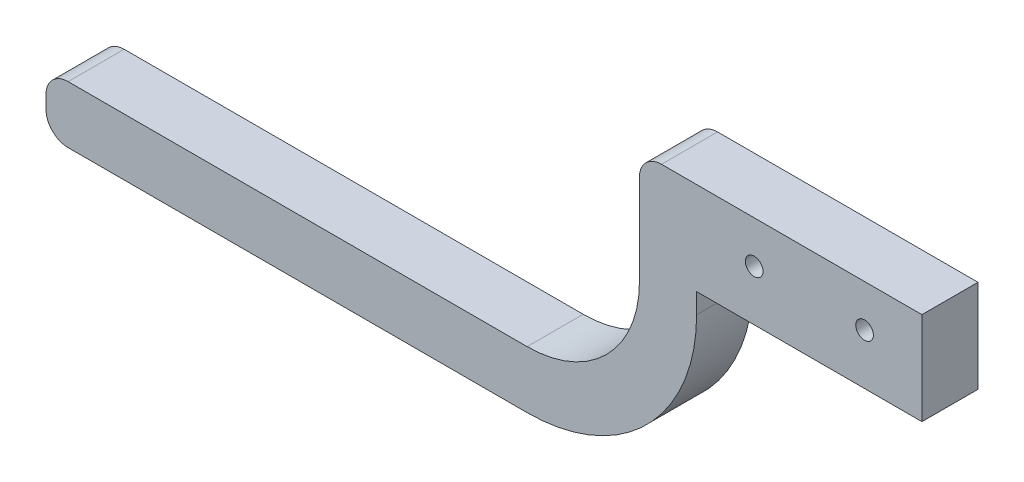
ISO-10303-21;
HEADER;
FILE_DESCRIPTION(('STEP AP214'),'2;1');
FILE_NAME('part.step','',(''),(''),'','','');
FILE_SCHEMA(('AUTOMOTIVE_DESIGN { 1 0 10303 214 1 1 1 1 }'));
ENDSEC;
DATA;
#1=APPLICATION_CONTEXT('core data for automotive mechanical design processes');
#2=APPLICATION_PROTOCOL_DEFINITION('international standard','automotive_design',2000,#1);
#3=PRODUCT_CONTEXT('',#1,'mechanical');
#4=PRODUCT('Part','Part','',(#3));
#5=PRODUCT_RELATED_PRODUCT_CATEGORY('part','',(#4));
#6=PRODUCT_DEFINITION_FORMATION('','',#4);
#7=PRODUCT_DEFINITION_CONTEXT('part definition',#1,'design');
#8=PRODUCT_DEFINITION('design','',#6,#7);
#9=PRODUCT_DEFINITION_SHAPE('','',#8);
#10=(LENGTH_UNIT() NAMED_UNIT(*) SI_UNIT(.MILLI.,.METRE.));
#11=(NAMED_UNIT(*) PLANE_ANGLE_UNIT() SI_UNIT($,.RADIAN.));
#12=(NAMED_UNIT(*) SI_UNIT($,.STERADIAN.) SOLID_ANGLE_UNIT());
#13=UNCERTAINTY_MEASURE_WITH_UNIT(LENGTH_MEASURE(1.E-05),#10,'distance_accuracy_value','');
#14=(GEOMETRIC_REPRESENTATION_CONTEXT(3) GLOBAL_UNCERTAINTY_ASSIGNED_CONTEXT((#13)) GLOBAL_UNIT_ASSIGNED_CONTEXT((#10,
#11,#12)) REPRESENTATION_CONTEXT('',''));
#15=CARTESIAN_POINT('',(0.,0.,0.));
#16=DIRECTION('',(0.,0.,1.));
#17=DIRECTION('',(1.,0.,0.));
#18=AXIS2_PLACEMENT_3D('',#15,#16,#17);
#19=CARTESIAN_POINT('',(0.,0.,12.7));
#20=DIRECTION('',(-1.,0.,0.));
#21=DIRECTION('',(0.,-1.,0.));
#22=AXIS2_PLACEMENT_3D('',#19,#20,#21);
#23=PLANE('',#22);
#24=DIRECTION('',(0.,1.,0.));
#25=VECTOR('',#24,1.);
#26=CARTESIAN_POINT('',(0.,0.,0.));
#27=LINE('',#26,#25);
#28=CARTESIAN_POINT('',(0.,-21.,0.));
#29=VERTEX_POINT('',#28);
#30=CARTESIAN_POINT('',(0.,0.,0.));
#31=VERTEX_POINT('',#30);
#32=EDGE_CURVE('E157',#29,#31,#27,.T.);
#33=ORIENTED_EDGE('',*,*,#32,.T.);
#34=DIRECTION('',(0.,0.,-1.));
#35=VECTOR('',#34,1.);
#36=CARTESIAN_POINT('',(0.,0.,12.7));
#37=LINE('',#36,#35);
#38=CARTESIAN_POINT('',(0.,0.,12.7));
#39=VERTEX_POINT('',#38);
#40=EDGE_CURVE('E139',#39,#31,#37,.T.);
#41=ORIENTED_EDGE('',*,*,#40,.F.);
#42=DIRECTION('',(0.,1.,0.));
#43=VECTOR('',#42,1.);
#44=CARTESIAN_POINT('',(0.,0.,12.7));
#45=LINE('',#44,#43);
#46=CARTESIAN_POINT('',(0.,-21.,12.7));
#47=VERTEX_POINT('',#46);
#48=EDGE_CURVE('E145',#47,#39,#45,.T.);
#49=ORIENTED_EDGE('',*,*,#48,.F.);
#50=DIRECTION('',(0.,0.,-1.));
#51=VECTOR('',#50,1.);
#52=CARTESIAN_POINT('',(0.,-21.,12.7));
#53=LINE('',#52,#51);
#54=EDGE_CURVE('E211',#47,#29,#53,.T.);
#55=ORIENTED_EDGE('',*,*,#54,.T.);
#56=EDGE_LOOP('',(#33,#41,#49,#55));
#57=FACE_BOUND('',#56,.T.);
#58=ADVANCED_FACE('F39',(#57),#23,.F.);
#59=CARTESIAN_POINT('',(0.,0.,12.7));
#60=DIRECTION('',(0.,-1.,0.));
#61=DIRECTION('',(1.,0.,0.));
#62=AXIS2_PLACEMENT_3D('',#59,#60,#61);
#63=PLANE('',#62);
#64=DIRECTION('',(-1.,0.,0.));
#65=VECTOR('',#64,1.);
#66=CARTESIAN_POINT('',(0.,0.,0.));
#67=LINE('',#66,#65);
#68=CARTESIAN_POINT('',(-59.,0.,0.));
#69=VERTEX_POINT('',#68);
#70=EDGE_CURVE('E233',#31,#69,#67,.T.);
#71=ORIENTED_EDGE('',*,*,#70,.T.);
#72=DIRECTION('',(0.,0.,-1.));
#73=VECTOR('',#72,1.);
#74=CARTESIAN_POINT('',(-59.,0.,12.7));
#75=LINE('',#74,#73);
#76=CARTESIAN_POINT('',(-59.,0.,12.7));
#77=VERTEX_POINT('',#76);
#78=EDGE_CURVE('E142',#69,#77,#75,.F.);
#79=ORIENTED_EDGE('',*,*,#78,.T.);
#80=DIRECTION('',(-1.,0.,0.));
#81=VECTOR('',#80,1.);
#82=CARTESIAN_POINT('',(0.,0.,12.7));
#83=LINE('',#82,#81);
#84=EDGE_CURVE('E134',#39,#77,#83,.T.);
#85=ORIENTED_EDGE('',*,*,#84,.F.);
#86=ORIENTED_EDGE('',*,*,#40,.T.);
#87=EDGE_LOOP('',(#71,#79,#85,#86));
#88=FACE_BOUND('',#87,.T.);
#89=ADVANCED_FACE('F137',(#88),#63,.F.);
#90=CARTESIAN_POINT('',(-64.,0.,12.7));
#91=DIRECTION('',(1.,0.,0.));
#92=DIRECTION('',(0.,0.,-1.));
#93=AXIS2_PLACEMENT_3D('',#90,#91,#92);
#94=PLANE('',#93);
#95=DIRECTION('',(0.,-1.,0.));
#96=VECTOR('',#95,1.);
#97=CARTESIAN_POINT('',(-64.,0.,12.7));
#98=LINE('',#97,#96);
#99=CARTESIAN_POINT('',(-64.,-5.00000000000001,12.7));
#100=VERTEX_POINT('',#99);
#101=CARTESIAN_POINT('',(-64.,-25.5521697441954,12.7));
#102=VERTEX_POINT('',#101);
#103=EDGE_CURVE('E144',#100,#102,#98,.T.);
#104=ORIENTED_EDGE('',*,*,#103,.F.);
#105=DIRECTION('',(0.,0.,-1.));
#106=VECTOR('',#105,1.);
#107=CARTESIAN_POINT('',(-64.,-5.00000000000001,12.7));
#108=LINE('',#107,#106);
#109=CARTESIAN_POINT('',(-64.,-5.00000000000001,0.));
#110=VERTEX_POINT('',#109);
#111=EDGE_CURVE('E158',#100,#110,#108,.T.);
#112=ORIENTED_EDGE('',*,*,#111,.T.);
#113=DIRECTION('',(0.,-1.,0.));
#114=VECTOR('',#113,1.);
#115=CARTESIAN_POINT('',(-64.,0.,0.));
#116=LINE('',#115,#114);
#117=CARTESIAN_POINT('',(-64.,-25.5521697441954,0.));
#118=VERTEX_POINT('',#117);
#119=EDGE_CURVE('E232',#110,#118,#116,.T.);
#120=ORIENTED_EDGE('',*,*,#119,.T.);
#121=DIRECTION('',(0.,0.,-1.));
#122=VECTOR('',#121,1.);
#123=CARTESIAN_POINT('',(-64.,-25.5521697441954,12.7));
#124=LINE('',#123,#122);
#125=EDGE_CURVE('E159',#102,#118,#124,.T.);
#126=ORIENTED_EDGE('',*,*,#125,.F.);
#127=EDGE_LOOP('',(#104,#112,#120,#126));
#128=FACE_BOUND('',#127,.T.);
#129=ADVANCED_FACE('F293',(#128),#94,.F.);
#130=CARTESIAN_POINT('',(-89.4478302558046,-25.5521697441954,12.7));
#131=DIRECTION('',(0.,0.,-1.));
#132=DIRECTION('',(-1.,0.,0.));
#133=AXIS2_PLACEMENT_3D('',#130,#131,#132);
#134=CYLINDRICAL_SURFACE('',#133,25.4478302558046);
#135=CARTESIAN_POINT('',(-89.4478302558046,-25.5521697441954,0.));
#136=DIRECTION('',(0.,0.,-1.));
#137=DIRECTION('',(-1.,0.,0.));
#138=AXIS2_PLACEMENT_3D('',#135,#136,#137);
#139=CIRCLE('',#138,25.4478302558046);
#140=CARTESIAN_POINT('',(-89.4478302558046,-51.,0.));
#141=VERTEX_POINT('',#140);
#142=EDGE_CURVE('E203',#118,#141,#139,.T.);
#143=ORIENTED_EDGE('',*,*,#142,.T.);
#144=DIRECTION('',(0.,0.,-1.));
#145=VECTOR('',#144,1.);
#146=CARTESIAN_POINT('',(-89.4478302558046,-51.,12.7));
#147=LINE('',#146,#145);
#148=CARTESIAN_POINT('',(-89.4478302558046,-51.,12.7));
#149=VERTEX_POINT('',#148);
#150=EDGE_CURVE('E165',#149,#141,#147,.T.);
#151=ORIENTED_EDGE('',*,*,#150,.F.);
#152=CARTESIAN_POINT('',(-89.4478302558046,-25.5521697441954,12.7));
#153=DIRECTION('',(0.,0.,-1.));
#154=DIRECTION('',(-1.,0.,0.));
#155=AXIS2_PLACEMENT_3D('',#152,#153,#154);
#156=CIRCLE('',#155,25.4478302558046);
#157=EDGE_CURVE('E248',#102,#149,#156,.T.);
#158=ORIENTED_EDGE('',*,*,#157,.F.);
#159=ORIENTED_EDGE('',*,*,#125,.T.);
#160=EDGE_LOOP('',(#143,#151,#158,#159));
#161=FACE_BOUND('',#160,.T.);
#162=ADVANCED_FACE('F324',(#161),#134,.F.);
#163=CARTESIAN_POINT('',(-89.4478302558046,-51.,12.7));
#164=DIRECTION('',(0.,-1.,0.));
#165=DIRECTION('',(1.,0.,0.));
#166=AXIS2_PLACEMENT_3D('',#163,#164,#165);
#167=PLANE('',#166);
#168=DIRECTION('',(-1.,0.,0.));
#169=VECTOR('',#168,1.);
#170=CARTESIAN_POINT('',(-89.4478302558046,-51.,0.));
#171=LINE('',#170,#169);
#172=CARTESIAN_POINT('',(-193.447830255805,-51.,0.));
#173=VERTEX_POINT('',#172);
#174=EDGE_CURVE('E199',#141,#173,#171,.T.);
#175=ORIENTED_EDGE('',*,*,#174,.T.);
#176=DIRECTION('',(0.,0.,-1.));
#177=VECTOR('',#176,1.);
#178=CARTESIAN_POINT('',(-193.447830255805,-51.,12.7));
#179=LINE('',#178,#177);
#180=CARTESIAN_POINT('',(-193.447830255805,-51.,12.7));
#181=VERTEX_POINT('',#180);
#182=EDGE_CURVE('E11',#173,#181,#179,.F.);
#183=ORIENTED_EDGE('',*,*,#182,.T.);
#184=DIRECTION('',(-1.,0.,0.));
#185=VECTOR('',#184,1.);
#186=CARTESIAN_POINT('',(-89.4478302558046,-51.,12.7));
#187=LINE('',#186,#185);
#188=EDGE_CURVE('E228',#149,#181,#187,.T.);
#189=ORIENTED_EDGE('',*,*,#188,.F.);
#190=ORIENTED_EDGE('',*,*,#150,.T.);
#191=EDGE_LOOP('',(#175,#183,#189,#190));
#192=FACE_BOUND('',#191,.T.);
#193=ADVANCED_FACE('F225',(#192),#167,.F.);
#194=CARTESIAN_POINT('',(-198.447830255805,-51.,12.7));
#195=DIRECTION('',(1.,0.,0.));
#196=DIRECTION('',(0.,0.,-1.));
#197=AXIS2_PLACEMENT_3D('',#194,#195,#196);
#198=PLANE('',#197);
#199=DIRECTION('',(0.,-1.,0.));
#200=VECTOR('',#199,1.);
#201=CARTESIAN_POINT('',(-198.447830255805,-51.,0.));
#202=LINE('',#201,#200);
#203=CARTESIAN_POINT('',(-198.447830255805,-56.,0.));
#204=VERTEX_POINT('',#203);
#205=CARTESIAN_POINT('',(-198.447830255805,-58.9558609804446,0.));
#206=VERTEX_POINT('',#205);
#207=EDGE_CURVE('E188',#204,#206,#202,.T.);
#208=ORIENTED_EDGE('',*,*,#207,.T.);
#209=DIRECTION('',(0.,0.,-1.));
#210=VECTOR('',#209,1.);
#211=CARTESIAN_POINT('',(-198.447830255805,-58.9558609804446,12.7));
#212=LINE('',#211,#210);
#213=CARTESIAN_POINT('',(-198.447830255805,-58.9558609804446,12.7));
#214=VERTEX_POINT('',#213);
#215=EDGE_CURVE('E47',#206,#214,#212,.F.);
#216=ORIENTED_EDGE('',*,*,#215,.T.);
#217=DIRECTION('',(0.,-1.,0.));
#218=VECTOR('',#217,1.);
#219=CARTESIAN_POINT('',(-198.447830255805,-51.,12.7));
#220=LINE('',#219,#218);
#221=CARTESIAN_POINT('',(-198.447830255805,-56.,12.7));
#222=VERTEX_POINT('',#221);
#223=EDGE_CURVE('E189',#222,#214,#220,.T.);
#224=ORIENTED_EDGE('',*,*,#223,.F.);
#225=DIRECTION('',(0.,0.,-1.));
#226=VECTOR('',#225,1.);
#227=CARTESIAN_POINT('',(-198.447830255805,-56.,12.7));
#228=LINE('',#227,#226);
#229=EDGE_CURVE('E183',#222,#204,#228,.T.);
#230=ORIENTED_EDGE('',*,*,#229,.T.);
#231=EDGE_LOOP('',(#208,#216,#224,#230));
#232=FACE_BOUND('',#231,.T.);
#233=ADVANCED_FACE('F187',(#232),#198,.F.);
#234=CARTESIAN_POINT('',(-198.447830255805,-63.9558609804446,12.7));
#235=DIRECTION('',(0.,1.,0.));
#236=DIRECTION('',(-1.,0.,0.));
#237=AXIS2_PLACEMENT_3D('',#234,#235,#236);
#238=PLANE('',#237);
#239=DIRECTION('',(1.,0.,0.));
#240=VECTOR('',#239,1.);
#241=CARTESIAN_POINT('',(-198.447830255805,-63.9558609804446,12.7));
#242=LINE('',#241,#240);
#243=CARTESIAN_POINT('',(-193.447830255805,-63.9558609804446,12.7));
#244=VERTEX_POINT('',#243);
#245=CARTESIAN_POINT('',(-89.4478302558046,-63.9558609804446,12.7));
#246=VERTEX_POINT('',#245);
#247=EDGE_CURVE('E244',#244,#246,#242,.T.);
#248=ORIENTED_EDGE('',*,*,#247,.F.);
#249=DIRECTION('',(0.,0.,-1.));
#250=VECTOR('',#249,1.);
#251=CARTESIAN_POINT('',(-193.447830255805,-63.9558609804446,12.7));
#252=LINE('',#251,#250);
#253=CARTESIAN_POINT('',(-193.447830255805,-63.9558609804446,0.));
#254=VERTEX_POINT('',#253);
#255=EDGE_CURVE('E180',#244,#254,#252,.T.);
#256=ORIENTED_EDGE('',*,*,#255,.T.);
#257=DIRECTION('',(1.,0.,0.));
#258=VECTOR('',#257,1.);
#259=CARTESIAN_POINT('',(-198.447830255805,-63.9558609804446,0.));
#260=LINE('',#259,#258);
#261=CARTESIAN_POINT('',(-89.4478302558046,-63.9558609804446,0.));
#262=VERTEX_POINT('',#261);
#263=EDGE_CURVE('E198',#254,#262,#260,.T.);
#264=ORIENTED_EDGE('',*,*,#263,.T.);
#265=DIRECTION('',(0.,0.,-1.));
#266=VECTOR('',#265,1.);
#267=CARTESIAN_POINT('',(-89.4478302558046,-63.9558609804446,12.7));
#268=LINE('',#267,#266);
#269=EDGE_CURVE('E219',#246,#262,#268,.T.);
#270=ORIENTED_EDGE('',*,*,#269,.F.);
#271=EDGE_LOOP('',(#248,#256,#264,#270));
#272=FACE_BOUND('',#271,.T.);
#273=ADVANCED_FACE('F306',(#272),#238,.F.);
#274=CARTESIAN_POINT('',(-89.4478302558046,-25.5521697441954,12.7));
#275=DIRECTION('',(0.,0.,-1.));
#276=DIRECTION('',(-1.,0.,0.));
#277=AXIS2_PLACEMENT_3D('',#274,#275,#276);
#278=CYLINDRICAL_SURFACE('',#277,38.4036912362492);
#279=CARTESIAN_POINT('',(-89.4478302558046,-25.5521697441954,0.));
#280=DIRECTION('',(0.,0.,1.));
#281=DIRECTION('',(1.,0.,0.));
#282=AXIS2_PLACEMENT_3D('',#279,#280,#281);
#283=CIRCLE('',#282,38.4036912362492);
#284=CARTESIAN_POINT('',(-51.0441390195554,-25.5521697441954,0.));
#285=VERTEX_POINT('',#284);
#286=EDGE_CURVE('E201',#262,#285,#283,.T.);
#287=ORIENTED_EDGE('',*,*,#286,.T.);
#288=DIRECTION('',(0.,0.,-1.));
#289=VECTOR('',#288,1.);
#290=CARTESIAN_POINT('',(-51.0441390195554,-25.5521697441954,12.7));
#291=LINE('',#290,#289);
#292=CARTESIAN_POINT('',(-51.0441390195554,-25.5521697441954,12.7));
#293=VERTEX_POINT('',#292);
#294=EDGE_CURVE('E216',#293,#285,#291,.T.);
#295=ORIENTED_EDGE('',*,*,#294,.F.);
#296=CARTESIAN_POINT('',(-89.4478302558046,-25.5521697441954,12.7));
#297=DIRECTION('',(0.,0.,1.));
#298=DIRECTION('',(1.,0.,0.));
#299=AXIS2_PLACEMENT_3D('',#296,#297,#298);
#300=CIRCLE('',#299,38.4036912362492);
#301=EDGE_CURVE('E242',#246,#293,#300,.T.);
#302=ORIENTED_EDGE('',*,*,#301,.F.);
#303=ORIENTED_EDGE('',*,*,#269,.T.);
#304=EDGE_LOOP('',(#287,#295,#302,#303));
#305=FACE_BOUND('',#304,.T.);
#306=ADVANCED_FACE('F313',(#305),#278,.T.);
#307=CARTESIAN_POINT('',(-51.0441390195554,-25.5521697441954,12.7));
#308=DIRECTION('',(-1.,0.,0.));
#309=DIRECTION('',(0.,0.,1.));
#310=AXIS2_PLACEMENT_3D('',#307,#308,#309);
#311=PLANE('',#310);
#312=DIRECTION('',(0.,1.,0.));
#313=VECTOR('',#312,1.);
#314=CARTESIAN_POINT('',(-51.0441390195554,-25.5521697441954,0.));
#315=LINE('',#314,#313);
#316=CARTESIAN_POINT('',(-51.0441390195554,-21.,0.));
#317=VERTEX_POINT('',#316);
#318=EDGE_CURVE('E208',#285,#317,#315,.T.);
#319=ORIENTED_EDGE('',*,*,#318,.T.);
#320=DIRECTION('',(0.,0.,-1.));
#321=VECTOR('',#320,1.);
#322=CARTESIAN_POINT('',(-51.0441390195554,-21.,12.7));
#323=LINE('',#322,#321);
#324=CARTESIAN_POINT('',(-51.0441390195554,-21.,12.7));
#325=VERTEX_POINT('',#324);
#326=EDGE_CURVE('E213',#325,#317,#323,.T.);
#327=ORIENTED_EDGE('',*,*,#326,.F.);
#328=DIRECTION('',(0.,1.,0.));
#329=VECTOR('',#328,1.);
#330=CARTESIAN_POINT('',(-51.0441390195554,-25.5521697441954,12.7));
#331=LINE('',#330,#329);
#332=EDGE_CURVE('E240',#293,#325,#331,.T.);
#333=ORIENTED_EDGE('',*,*,#332,.F.);
#334=ORIENTED_EDGE('',*,*,#294,.T.);
#335=EDGE_LOOP('',(#319,#327,#333,#334));
#336=FACE_BOUND('',#335,.T.);
#337=ADVANCED_FACE('F317',(#336),#311,.F.);
#338=CARTESIAN_POINT('',(0.,-21.,12.7));
#339=DIRECTION('',(0.,1.,0.));
#340=DIRECTION('',(-1.,0.,0.));
#341=AXIS2_PLACEMENT_3D('',#338,#339,#340);
#342=PLANE('',#341);
#343=DIRECTION('',(1.,0.,0.));
#344=VECTOR('',#343,1.);
#345=CARTESIAN_POINT('',(0.,-21.,0.));
#346=LINE('',#345,#344);
#347=EDGE_CURVE('E154',#317,#29,#346,.T.);
#348=ORIENTED_EDGE('',*,*,#347,.T.);
#349=ORIENTED_EDGE('',*,*,#54,.F.);
#350=DIRECTION('',(1.,0.,0.));
#351=VECTOR('',#350,1.);
#352=CARTESIAN_POINT('',(0.,-21.,12.7));
#353=LINE('',#352,#351);
#354=EDGE_CURVE('E150',#325,#47,#353,.T.);
#355=ORIENTED_EDGE('',*,*,#354,.F.);
#356=ORIENTED_EDGE('',*,*,#326,.T.);
#357=EDGE_LOOP('',(#348,#349,#355,#356));
#358=FACE_BOUND('',#357,.T.);
#359=ADVANCED_FACE('F274',(#358),#342,.F.);
#360=CARTESIAN_POINT('',(-89.4478302558046,-25.5521697441954,12.7));
#361=DIRECTION('',(0.,0.,1.));
#362=DIRECTION('',(1.,0.,0.));
#363=AXIS2_PLACEMENT_3D('',#360,#361,#362);
#364=PLANE('',#363);
#365=CARTESIAN_POINT('',(-13.,-9.53160990304612,12.7));
#366=DIRECTION('',(0.,0.,1.));
#367=DIRECTION('',(1.,0.,0.));
#368=AXIS2_PLACEMENT_3D('',#365,#366,#367);
#369=CIRCLE('',#368,2.);
#370=CARTESIAN_POINT('',(-11.,-9.53160990304612,12.7));
#371=VERTEX_POINT('',#370);
#372=EDGE_CURVE('E257',#371,#371,#369,.T.);
#373=ORIENTED_EDGE('',*,*,#372,.F.);
#374=EDGE_LOOP('',(#373));
#375=FACE_BOUND('',#374,.T.);
#376=CARTESIAN_POINT('',(-38.,-9.53160990304612,12.7));
#377=DIRECTION('',(0.,0.,1.));
#378=DIRECTION('',(1.,0.,0.));
#379=AXIS2_PLACEMENT_3D('',#376,#377,#378);
#380=CIRCLE('',#379,2.);
#381=CARTESIAN_POINT('',(-36.,-9.53160990304612,12.7));
#382=VERTEX_POINT('',#381);
#383=EDGE_CURVE('E254',#382,#382,#380,.T.);
#384=ORIENTED_EDGE('',*,*,#383,.F.);
#385=EDGE_LOOP('',(#384));
#386=FACE_BOUND('',#385,.T.);
#387=ORIENTED_EDGE('',*,*,#84,.T.);
#388=CARTESIAN_POINT('',(-59.,-5.00000000000001,12.7));
#389=DIRECTION('',(0.,0.,1.));
#390=DIRECTION('',(1.,0.,0.));
#391=AXIS2_PLACEMENT_3D('',#388,#389,#390);
#392=CIRCLE('',#391,5.);
#393=EDGE_CURVE('E178',#77,#100,#392,.T.);
#394=ORIENTED_EDGE('',*,*,#393,.T.);
#395=ORIENTED_EDGE('',*,*,#103,.T.);
#396=ORIENTED_EDGE('',*,*,#157,.T.);
#397=ORIENTED_EDGE('',*,*,#188,.T.);
#398=CARTESIAN_POINT('',(-193.447830255805,-56.,12.7));
#399=DIRECTION('',(0.,0.,1.));
#400=DIRECTION('',(1.,0.,0.));
#401=AXIS2_PLACEMENT_3D('',#398,#399,#400);
#402=CIRCLE('',#401,5.);
#403=EDGE_CURVE('E175',#181,#222,#402,.T.);
#404=ORIENTED_EDGE('',*,*,#403,.T.);
#405=ORIENTED_EDGE('',*,*,#223,.T.);
#406=CARTESIAN_POINT('',(-193.447830255805,-58.9558609804446,12.7));
#407=DIRECTION('',(0.,0.,1.));
#408=DIRECTION('',(1.,0.,0.));
#409=AXIS2_PLACEMENT_3D('',#406,#407,#408);
#410=CIRCLE('',#409,5.);
#411=EDGE_CURVE('E54',#214,#244,#410,.T.);
#412=ORIENTED_EDGE('',*,*,#411,.T.);
#413=ORIENTED_EDGE('',*,*,#247,.T.);
#414=ORIENTED_EDGE('',*,*,#301,.T.);
#415=ORIENTED_EDGE('',*,*,#332,.T.);
#416=ORIENTED_EDGE('',*,*,#354,.T.);
#417=ORIENTED_EDGE('',*,*,#48,.T.);
#418=EDGE_LOOP('',(#387,#394,#395,#396,#397,#404,#405,#412,#413,#414,#415,#416,#417));
#419=FACE_BOUND('',#418,.T.);
#420=ADVANCED_FACE('F148',(#375,#386,#419),#364,.T.);
#421=CARTESIAN_POINT('',(-89.4478302558046,-25.5521697441954,0.));
#422=DIRECTION('',(0.,0.,1.));
#423=DIRECTION('',(1.,0.,0.));
#424=AXIS2_PLACEMENT_3D('',#421,#422,#423);
#425=PLANE('',#424);
#426=CARTESIAN_POINT('',(-13.,-9.53160990304612,0.));
#427=DIRECTION('',(0.,0.,1.));
#428=DIRECTION('',(1.,0.,0.));
#429=AXIS2_PLACEMENT_3D('',#426,#427,#428);
#430=CIRCLE('',#429,2.);
#431=CARTESIAN_POINT('',(-11.,-9.53160990304612,0.));
#432=VERTEX_POINT('',#431);
#433=EDGE_CURVE('E238',#432,#432,#430,.T.);
#434=ORIENTED_EDGE('',*,*,#433,.T.);
#435=EDGE_LOOP('',(#434));
#436=FACE_BOUND('',#435,.T.);
#437=CARTESIAN_POINT('',(-38.,-9.53160990304612,0.));
#438=DIRECTION('',(0.,0.,1.));
#439=DIRECTION('',(1.,0.,0.));
#440=AXIS2_PLACEMENT_3D('',#437,#438,#439);
#441=CIRCLE('',#440,2.);
#442=CARTESIAN_POINT('',(-36.,-9.53160990304612,0.));
#443=VERTEX_POINT('',#442);
#444=EDGE_CURVE('E251',#443,#443,#441,.T.);
#445=ORIENTED_EDGE('',*,*,#444,.T.);
#446=EDGE_LOOP('',(#445));
#447=FACE_BOUND('',#446,.T.);
#448=ORIENTED_EDGE('',*,*,#119,.F.);
#449=CARTESIAN_POINT('',(-59.,-5.00000000000001,0.));
#450=DIRECTION('',(0.,0.,1.));
#451=DIRECTION('',(1.,0.,0.));
#452=AXIS2_PLACEMENT_3D('',#449,#450,#451);
#453=CIRCLE('',#452,5.);
#454=EDGE_CURVE('E172',#110,#69,#453,.F.);
#455=ORIENTED_EDGE('',*,*,#454,.T.);
#456=ORIENTED_EDGE('',*,*,#70,.F.);
#457=ORIENTED_EDGE('',*,*,#32,.F.);
#458=ORIENTED_EDGE('',*,*,#347,.F.);
#459=ORIENTED_EDGE('',*,*,#318,.F.);
#460=ORIENTED_EDGE('',*,*,#286,.F.);
#461=ORIENTED_EDGE('',*,*,#263,.F.);
#462=CARTESIAN_POINT('',(-193.447830255805,-58.9558609804446,0.));
#463=DIRECTION('',(0.,0.,1.));
#464=DIRECTION('',(1.,0.,0.));
#465=AXIS2_PLACEMENT_3D('',#462,#463,#464);
#466=CIRCLE('',#465,5.);
#467=EDGE_CURVE('E170',#254,#206,#466,.F.);
#468=ORIENTED_EDGE('',*,*,#467,.T.);
#469=ORIENTED_EDGE('',*,*,#207,.F.);
#470=CARTESIAN_POINT('',(-193.447830255805,-56.,0.));
#471=DIRECTION('',(0.,0.,1.));
#472=DIRECTION('',(1.,0.,0.));
#473=AXIS2_PLACEMENT_3D('',#470,#471,#472);
#474=CIRCLE('',#473,5.);
#475=EDGE_CURVE('E162',#204,#173,#474,.F.);
#476=ORIENTED_EDGE('',*,*,#475,.T.);
#477=ORIENTED_EDGE('',*,*,#174,.F.);
#478=ORIENTED_EDGE('',*,*,#142,.F.);
#479=EDGE_LOOP('',(#448,#455,#456,#457,#458,#459,#460,#461,#468,#469,#476,#477,#478));
#480=FACE_BOUND('',#479,.T.);
#481=ADVANCED_FACE('F194',(#436,#447,#480),#425,.F.);
#482=CARTESIAN_POINT('',(-59.,-5.00000000000001,12.7));
#483=DIRECTION('',(0.,0.,-1.));
#484=DIRECTION('',(-1.,0.,0.));
#485=AXIS2_PLACEMENT_3D('',#482,#483,#484);
#486=CYLINDRICAL_SURFACE('',#485,5.);
#487=ORIENTED_EDGE('',*,*,#393,.F.);
#488=ORIENTED_EDGE('',*,*,#78,.F.);
#489=ORIENTED_EDGE('',*,*,#454,.F.);
#490=ORIENTED_EDGE('',*,*,#111,.F.);
#491=EDGE_LOOP('',(#487,#488,#489,#490));
#492=FACE_BOUND('',#491,.T.);
#493=ADVANCED_FACE('F297',(#492),#486,.T.);
#494=CARTESIAN_POINT('',(-193.447830255805,-58.9558609804446,12.7));
#495=DIRECTION('',(0.,0.,-1.));
#496=DIRECTION('',(-1.,0.,0.));
#497=AXIS2_PLACEMENT_3D('',#494,#495,#496);
#498=CYLINDRICAL_SURFACE('',#497,5.);
#499=ORIENTED_EDGE('',*,*,#411,.F.);
#500=ORIENTED_EDGE('',*,*,#215,.F.);
#501=ORIENTED_EDGE('',*,*,#467,.F.);
#502=ORIENTED_EDGE('',*,*,#255,.F.);
#503=EDGE_LOOP('',(#499,#500,#501,#502));
#504=FACE_BOUND('',#503,.T.);
#505=ADVANCED_FACE('F285',(#504),#498,.T.);
#506=CARTESIAN_POINT('',(-193.447830255805,-56.,12.7));
#507=DIRECTION('',(0.,0.,-1.));
#508=DIRECTION('',(-1.,0.,0.));
#509=AXIS2_PLACEMENT_3D('',#506,#507,#508);
#510=CYLINDRICAL_SURFACE('',#509,5.);
#511=ORIENTED_EDGE('',*,*,#403,.F.);
#512=ORIENTED_EDGE('',*,*,#182,.F.);
#513=ORIENTED_EDGE('',*,*,#475,.F.);
#514=ORIENTED_EDGE('',*,*,#229,.F.);
#515=EDGE_LOOP('',(#511,#512,#513,#514));
#516=FACE_BOUND('',#515,.T.);
#517=ADVANCED_FACE('F41',(#516),#510,.T.);
#518=CARTESIAN_POINT('',(-38.,-9.53160990304612,0.));
#519=DIRECTION('',(0.,0.,1.));
#520=DIRECTION('',(1.,0.,0.));
#521=AXIS2_PLACEMENT_3D('',#518,#519,#520);
#522=CYLINDRICAL_SURFACE('',#521,2.);
#523=ORIENTED_EDGE('',*,*,#444,.F.);
#524=EDGE_LOOP('',(#523));
#525=FACE_BOUND('',#524,.T.);
#526=ORIENTED_EDGE('',*,*,#383,.T.);
#527=EDGE_LOOP('',(#526));
#528=FACE_BOUND('',#527,.T.);
#529=ADVANCED_FACE('F268',(#525,#528),#522,.F.);
#530=CARTESIAN_POINT('',(-13.,-9.53160990304612,0.));
#531=DIRECTION('',(0.,0.,1.));
#532=DIRECTION('',(1.,0.,0.));
#533=AXIS2_PLACEMENT_3D('',#530,#531,#532);
#534=CYLINDRICAL_SURFACE('',#533,2.);
#535=ORIENTED_EDGE('',*,*,#433,.F.);
#536=EDGE_LOOP('',(#535));
#537=FACE_BOUND('',#536,.T.);
#538=ORIENTED_EDGE('',*,*,#372,.T.);
#539=EDGE_LOOP('',(#538));
#540=FACE_BOUND('',#539,.T.);
#541=ADVANCED_FACE('F265',(#537,#540),#534,.F.);
#542=CLOSED_SHELL('',(#58,#89,#129,#162,#193,#233,#273,#306,#337,#359,#420,#481,#493,#505,#517,
#529,#541));
#543=MANIFOLD_SOLID_BREP('B2',#542);
#544=ADVANCED_BREP_SHAPE_REPRESENTATION('',(#18,#543),#14);
#545=SHAPE_DEFINITION_REPRESENTATION(#9,#544);
ENDSEC;
END-ISO-10303-21;
